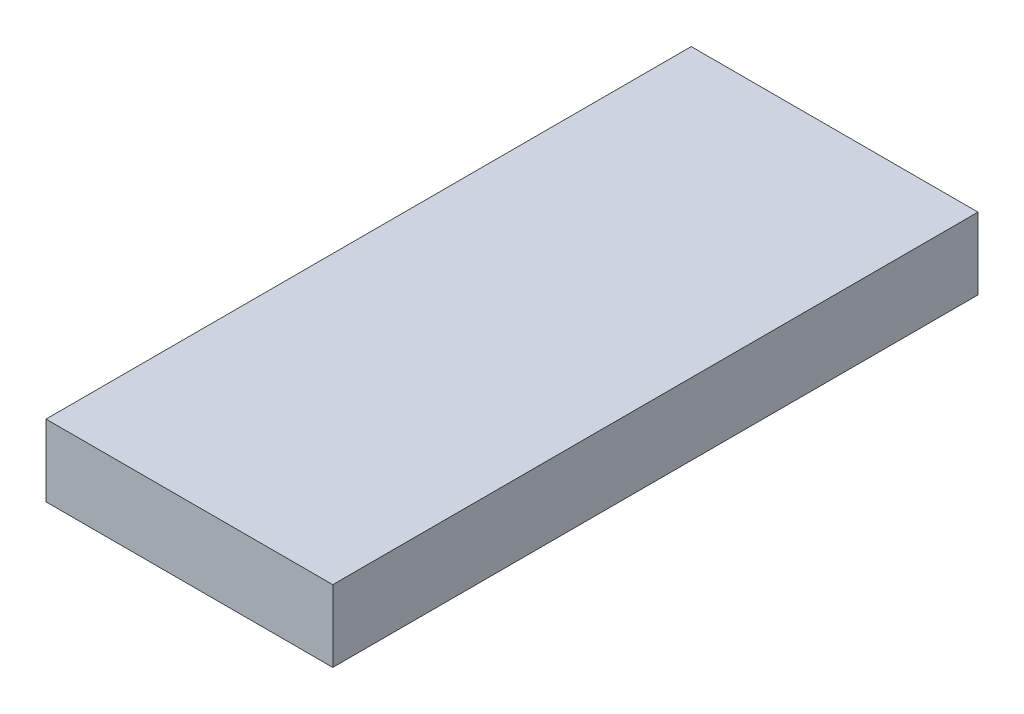
ISO-10303-21;
HEADER;
FILE_DESCRIPTION(('STEP AP214'),'2;1');
FILE_NAME('part.step','',(''),(''),'','','');
FILE_SCHEMA(('AUTOMOTIVE_DESIGN { 1 0 10303 214 1 1 1 1 }'));
ENDSEC;
DATA;
#1=APPLICATION_CONTEXT('core data for automotive mechanical design processes');
#2=APPLICATION_PROTOCOL_DEFINITION('international standard','automotive_design',2000,#1);
#3=PRODUCT_CONTEXT('',#1,'mechanical');
#4=PRODUCT('Part','Part','',(#3));
#5=PRODUCT_RELATED_PRODUCT_CATEGORY('part','',(#4));
#6=PRODUCT_DEFINITION_FORMATION('','',#4);
#7=PRODUCT_DEFINITION_CONTEXT('part definition',#1,'design');
#8=PRODUCT_DEFINITION('design','',#6,#7);
#9=PRODUCT_DEFINITION_SHAPE('','',#8);
#10=(LENGTH_UNIT() NAMED_UNIT(*) SI_UNIT(.MILLI.,.METRE.));
#11=(NAMED_UNIT(*) PLANE_ANGLE_UNIT() SI_UNIT($,.RADIAN.));
#12=(NAMED_UNIT(*) SI_UNIT($,.STERADIAN.) SOLID_ANGLE_UNIT());
#13=UNCERTAINTY_MEASURE_WITH_UNIT(LENGTH_MEASURE(1.E-05),#10,'distance_accuracy_value','');
#14=(GEOMETRIC_REPRESENTATION_CONTEXT(3) GLOBAL_UNCERTAINTY_ASSIGNED_CONTEXT((#13)) GLOBAL_UNIT_ASSIGNED_CONTEXT((#10,
#11,#12)) REPRESENTATION_CONTEXT('',''));
#15=CARTESIAN_POINT('',(0.,0.,0.));
#16=DIRECTION('',(0.,0.,1.));
#17=DIRECTION('',(1.,0.,0.));
#18=AXIS2_PLACEMENT_3D('',#15,#16,#17);
#19=CARTESIAN_POINT('',(10.,5.,-22.5));
#20=DIRECTION('',(-1.,0.,0.));
#21=DIRECTION('',(0.,0.,1.));
#22=AXIS2_PLACEMENT_3D('',#19,#20,#21);
#23=PLANE('',#22);
#24=DIRECTION('',(0.,0.,-1.));
#25=VECTOR('',#24,1.);
#26=CARTESIAN_POINT('',(10.,0.,-22.5));
#27=LINE('',#26,#25);
#28=CARTESIAN_POINT('',(10.,0.,22.5));
#29=VERTEX_POINT('',#28);
#30=CARTESIAN_POINT('',(10.,0.,-22.5));
#31=VERTEX_POINT('',#30);
#32=EDGE_CURVE('E96',#29,#31,#27,.T.);
#33=ORIENTED_EDGE('',*,*,#32,.T.);
#34=DIRECTION('',(0.,-1.,0.));
#35=VECTOR('',#34,1.);
#36=CARTESIAN_POINT('',(10.,5.,-22.5));
#37=LINE('',#36,#35);
#38=CARTESIAN_POINT('',(10.,5.,-22.5));
#39=VERTEX_POINT('',#38);
#40=EDGE_CURVE('E11',#39,#31,#37,.T.);
#41=ORIENTED_EDGE('',*,*,#40,.F.);
#42=DIRECTION('',(0.,0.,-1.));
#43=VECTOR('',#42,1.);
#44=CARTESIAN_POINT('',(10.,5.,-22.5));
#45=LINE('',#44,#43);
#46=CARTESIAN_POINT('',(10.,5.,22.5));
#47=VERTEX_POINT('',#46);
#48=EDGE_CURVE('E84',#47,#39,#45,.T.);
#49=ORIENTED_EDGE('',*,*,#48,.F.);
#50=DIRECTION('',(0.,-1.,0.));
#51=VECTOR('',#50,1.);
#52=CARTESIAN_POINT('',(10.,5.,22.5));
#53=LINE('',#52,#51);
#54=EDGE_CURVE('E92',#47,#29,#53,.T.);
#55=ORIENTED_EDGE('',*,*,#54,.T.);
#56=EDGE_LOOP('',(#33,#41,#49,#55));
#57=FACE_BOUND('',#56,.T.);
#58=ADVANCED_FACE('F33',(#57),#23,.F.);
#59=CARTESIAN_POINT('',(-10.,5.,-22.5));
#60=DIRECTION('',(0.,0.,1.));
#61=DIRECTION('',(1.,0.,0.));
#62=AXIS2_PLACEMENT_3D('',#59,#60,#61);
#63=PLANE('',#62);
#64=DIRECTION('',(-1.,0.,0.));
#65=VECTOR('',#64,1.);
#66=CARTESIAN_POINT('',(-10.,0.,-22.5));
#67=LINE('',#66,#65);
#68=CARTESIAN_POINT('',(-10.,0.,-22.5));
#69=VERTEX_POINT('',#68);
#70=EDGE_CURVE('E88',#31,#69,#67,.T.);
#71=ORIENTED_EDGE('',*,*,#70,.T.);
#72=DIRECTION('',(0.,-1.,0.));
#73=VECTOR('',#72,1.);
#74=CARTESIAN_POINT('',(-10.,5.,-22.5));
#75=LINE('',#74,#73);
#76=CARTESIAN_POINT('',(-10.,5.,-22.5));
#77=VERTEX_POINT('',#76);
#78=EDGE_CURVE('E41',#77,#69,#75,.T.);
#79=ORIENTED_EDGE('',*,*,#78,.F.);
#80=DIRECTION('',(-1.,0.,0.));
#81=VECTOR('',#80,1.);
#82=CARTESIAN_POINT('',(-10.,5.,-22.5));
#83=LINE('',#82,#81);
#84=EDGE_CURVE('E79',#39,#77,#83,.T.);
#85=ORIENTED_EDGE('',*,*,#84,.F.);
#86=ORIENTED_EDGE('',*,*,#40,.T.);
#87=EDGE_LOOP('',(#71,#79,#85,#86));
#88=FACE_BOUND('',#87,.T.);
#89=ADVANCED_FACE('F87',(#88),#63,.F.);
#90=CARTESIAN_POINT('',(-10.,5.,-22.5));
#91=DIRECTION('',(1.,0.,0.));
#92=DIRECTION('',(0.,0.,-1.));
#93=AXIS2_PLACEMENT_3D('',#90,#91,#92);
#94=PLANE('',#93);
#95=DIRECTION('',(0.,0.,1.));
#96=VECTOR('',#95,1.);
#97=CARTESIAN_POINT('',(-10.,0.,-22.5));
#98=LINE('',#97,#96);
#99=CARTESIAN_POINT('',(-10.,0.,22.5));
#100=VERTEX_POINT('',#99);
#101=EDGE_CURVE('E66',#69,#100,#98,.T.);
#102=ORIENTED_EDGE('',*,*,#101,.T.);
#103=DIRECTION('',(0.,-1.,0.));
#104=VECTOR('',#103,1.);
#105=CARTESIAN_POINT('',(-10.,5.,22.5));
#106=LINE('',#105,#104);
#107=CARTESIAN_POINT('',(-10.,5.,22.5));
#108=VERTEX_POINT('',#107);
#109=EDGE_CURVE('E89',#108,#100,#106,.T.);
#110=ORIENTED_EDGE('',*,*,#109,.F.);
#111=DIRECTION('',(0.,0.,1.));
#112=VECTOR('',#111,1.);
#113=CARTESIAN_POINT('',(-10.,5.,-22.5));
#114=LINE('',#113,#112);
#115=EDGE_CURVE('E82',#77,#108,#114,.T.);
#116=ORIENTED_EDGE('',*,*,#115,.F.);
#117=ORIENTED_EDGE('',*,*,#78,.T.);
#118=EDGE_LOOP('',(#102,#110,#116,#117));
#119=FACE_BOUND('',#118,.T.);
#120=ADVANCED_FACE('F90',(#119),#94,.F.);
#121=CARTESIAN_POINT('',(-10.,5.,22.5));
#122=DIRECTION('',(0.,0.,-1.));
#123=DIRECTION('',(-1.,0.,0.));
#124=AXIS2_PLACEMENT_3D('',#121,#122,#123);
#125=PLANE('',#124);
#126=DIRECTION('',(1.,0.,0.));
#127=VECTOR('',#126,1.);
#128=CARTESIAN_POINT('',(-10.,0.,22.5));
#129=LINE('',#128,#127);
#130=EDGE_CURVE('E72',#100,#29,#129,.T.);
#131=ORIENTED_EDGE('',*,*,#130,.T.);
#132=ORIENTED_EDGE('',*,*,#54,.F.);
#133=DIRECTION('',(1.,0.,0.));
#134=VECTOR('',#133,1.);
#135=CARTESIAN_POINT('',(-10.,5.,22.5));
#136=LINE('',#135,#134);
#137=EDGE_CURVE('E49',#108,#47,#136,.T.);
#138=ORIENTED_EDGE('',*,*,#137,.F.);
#139=ORIENTED_EDGE('',*,*,#109,.T.);
#140=EDGE_LOOP('',(#131,#132,#138,#139));
#141=FACE_BOUND('',#140,.T.);
#142=ADVANCED_FACE('F103',(#141),#125,.F.);
#143=CARTESIAN_POINT('',(0.,5.,0.));
#144=DIRECTION('',(0.,1.,0.));
#145=DIRECTION('',(0.,0.,1.));
#146=AXIS2_PLACEMENT_3D('',#143,#144,#145);
#147=PLANE('',#146);
#148=ORIENTED_EDGE('',*,*,#48,.T.);
#149=ORIENTED_EDGE('',*,*,#84,.T.);
#150=ORIENTED_EDGE('',*,*,#115,.T.);
#151=ORIENTED_EDGE('',*,*,#137,.T.);
#152=EDGE_LOOP('',(#148,#149,#150,#151));
#153=FACE_BOUND('',#152,.T.);
#154=ADVANCED_FACE('F80',(#153),#147,.T.);
#155=CARTESIAN_POINT('',(0.,0.,0.));
#156=DIRECTION('',(0.,1.,0.));
#157=DIRECTION('',(0.,0.,1.));
#158=AXIS2_PLACEMENT_3D('',#155,#156,#157);
#159=PLANE('',#158);
#160=ORIENTED_EDGE('',*,*,#32,.F.);
#161=ORIENTED_EDGE('',*,*,#130,.F.);
#162=ORIENTED_EDGE('',*,*,#101,.F.);
#163=ORIENTED_EDGE('',*,*,#70,.F.);
#164=EDGE_LOOP('',(#160,#161,#162,#163));
#165=FACE_BOUND('',#164,.T.);
#166=ADVANCED_FACE('F106',(#165),#159,.F.);
#167=CLOSED_SHELL('',(#58,#89,#120,#142,#154,#166));
#168=MANIFOLD_SOLID_BREP('B2',#167);
#169=ADVANCED_BREP_SHAPE_REPRESENTATION('',(#18,#168),#14);
#170=SHAPE_DEFINITION_REPRESENTATION(#9,#169);
ENDSEC;
END-ISO-10303-21;
